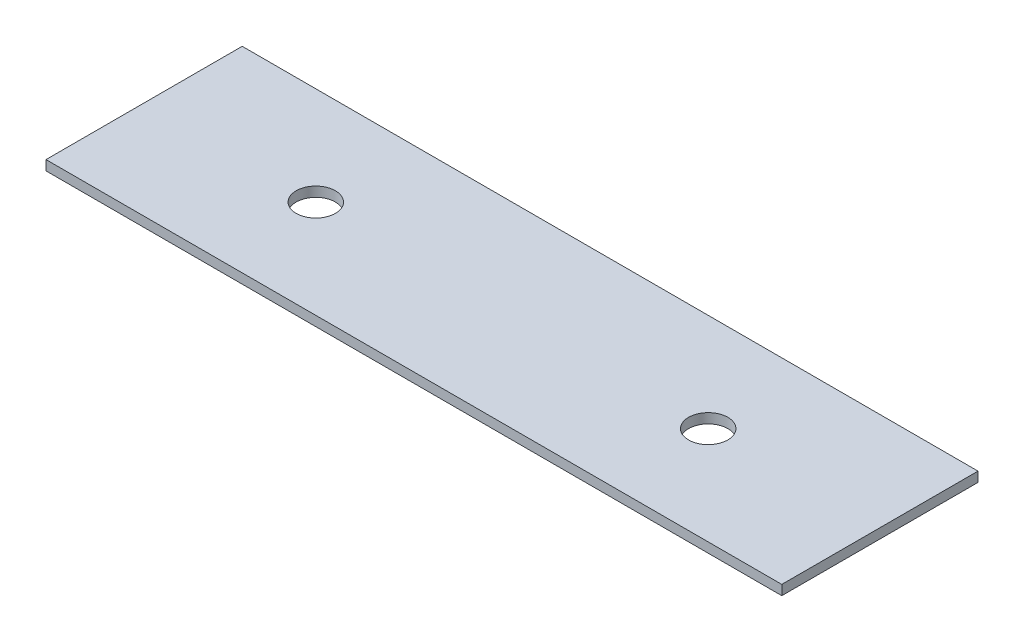
ISO-10303-21;
HEADER;
FILE_DESCRIPTION(('STEP AP214'),'2;1');
FILE_NAME('part.step','',(''),(''),'','','');
FILE_SCHEMA(('AUTOMOTIVE_DESIGN { 1 0 10303 214 1 1 1 1 }'));
ENDSEC;
DATA;
#1=APPLICATION_CONTEXT('core data for automotive mechanical design processes');
#2=APPLICATION_PROTOCOL_DEFINITION('international standard','automotive_design',2000,#1);
#3=PRODUCT_CONTEXT('',#1,'mechanical');
#4=PRODUCT('Part','Part','',(#3));
#5=PRODUCT_RELATED_PRODUCT_CATEGORY('part','',(#4));
#6=PRODUCT_DEFINITION_FORMATION('','',#4);
#7=PRODUCT_DEFINITION_CONTEXT('part definition',#1,'design');
#8=PRODUCT_DEFINITION('design','',#6,#7);
#9=PRODUCT_DEFINITION_SHAPE('','',#8);
#10=(LENGTH_UNIT() NAMED_UNIT(*) SI_UNIT(.MILLI.,.METRE.));
#11=(NAMED_UNIT(*) PLANE_ANGLE_UNIT() SI_UNIT($,.RADIAN.));
#12=(NAMED_UNIT(*) SI_UNIT($,.STERADIAN.) SOLID_ANGLE_UNIT());
#13=UNCERTAINTY_MEASURE_WITH_UNIT(LENGTH_MEASURE(1.E-05),#10,'distance_accuracy_value','');
#14=(GEOMETRIC_REPRESENTATION_CONTEXT(3) GLOBAL_UNCERTAINTY_ASSIGNED_CONTEXT((#13)) GLOBAL_UNIT_ASSIGNED_CONTEXT((#10,
#11,#12)) REPRESENTATION_CONTEXT('',''));
#15=CARTESIAN_POINT('',(0.,0.,0.));
#16=DIRECTION('',(0.,0.,1.));
#17=DIRECTION('',(1.,0.,0.));
#18=AXIS2_PLACEMENT_3D('',#15,#16,#17);
#19=CARTESIAN_POINT('',(75.,-2.,-20.));
#20=DIRECTION('',(1.,0.,0.));
#21=DIRECTION('',(0.,0.,-1.));
#22=AXIS2_PLACEMENT_3D('',#19,#20,#21);
#23=PLANE('',#22);
#24=DIRECTION('',(0.,0.,-1.));
#25=VECTOR('',#24,1.);
#26=CARTESIAN_POINT('',(75.,0.,-20.));
#27=LINE('',#26,#25);
#28=CARTESIAN_POINT('',(75.,0.,20.));
#29=VERTEX_POINT('',#28);
#30=CARTESIAN_POINT('',(75.,0.,-20.));
#31=VERTEX_POINT('',#30);
#32=EDGE_CURVE('E103',#29,#31,#27,.T.);
#33=ORIENTED_EDGE('',*,*,#32,.F.);
#34=DIRECTION('',(0.,1.,0.));
#35=VECTOR('',#34,1.);
#36=CARTESIAN_POINT('',(75.,-2.,20.));
#37=LINE('',#36,#35);
#38=CARTESIAN_POINT('',(75.,-2.,20.));
#39=VERTEX_POINT('',#38);
#40=EDGE_CURVE('E11',#39,#29,#37,.T.);
#41=ORIENTED_EDGE('',*,*,#40,.F.);
#42=DIRECTION('',(0.,0.,-1.));
#43=VECTOR('',#42,1.);
#44=CARTESIAN_POINT('',(75.,-2.,-20.));
#45=LINE('',#44,#43);
#46=CARTESIAN_POINT('',(75.,-2.,-20.));
#47=VERTEX_POINT('',#46);
#48=EDGE_CURVE('E96',#39,#47,#45,.T.);
#49=ORIENTED_EDGE('',*,*,#48,.T.);
#50=DIRECTION('',(0.,1.,0.));
#51=VECTOR('',#50,1.);
#52=CARTESIAN_POINT('',(75.,-2.,-20.));
#53=LINE('',#52,#51);
#54=EDGE_CURVE('E41',#47,#31,#53,.T.);
#55=ORIENTED_EDGE('',*,*,#54,.T.);
#56=EDGE_LOOP('',(#33,#41,#49,#55));
#57=FACE_BOUND('',#56,.T.);
#58=ADVANCED_FACE('F38',(#57),#23,.T.);
#59=CARTESIAN_POINT('',(-75.,-2.,20.));
#60=DIRECTION('',(0.,0.,1.));
#61=DIRECTION('',(1.,0.,0.));
#62=AXIS2_PLACEMENT_3D('',#59,#60,#61);
#63=PLANE('',#62);
#64=DIRECTION('',(1.,0.,0.));
#65=VECTOR('',#64,1.);
#66=CARTESIAN_POINT('',(-75.,0.,20.));
#67=LINE('',#66,#65);
#68=CARTESIAN_POINT('',(-75.,0.,20.));
#69=VERTEX_POINT('',#68);
#70=EDGE_CURVE('E98',#69,#29,#67,.T.);
#71=ORIENTED_EDGE('',*,*,#70,.F.);
#72=DIRECTION('',(0.,1.,0.));
#73=VECTOR('',#72,1.);
#74=CARTESIAN_POINT('',(-75.,-2.,20.));
#75=LINE('',#74,#73);
#76=CARTESIAN_POINT('',(-75.,-2.,20.));
#77=VERTEX_POINT('',#76);
#78=EDGE_CURVE('E47',#77,#69,#75,.T.);
#79=ORIENTED_EDGE('',*,*,#78,.F.);
#80=DIRECTION('',(1.,0.,0.));
#81=VECTOR('',#80,1.);
#82=CARTESIAN_POINT('',(-75.,-2.,20.));
#83=LINE('',#82,#81);
#84=EDGE_CURVE('E93',#77,#39,#83,.T.);
#85=ORIENTED_EDGE('',*,*,#84,.T.);
#86=ORIENTED_EDGE('',*,*,#40,.T.);
#87=EDGE_LOOP('',(#71,#79,#85,#86));
#88=FACE_BOUND('',#87,.T.);
#89=ADVANCED_FACE('F114',(#88),#63,.T.);
#90=CARTESIAN_POINT('',(-75.,-2.,-20.));
#91=DIRECTION('',(-1.,0.,0.));
#92=DIRECTION('',(0.,0.,1.));
#93=AXIS2_PLACEMENT_3D('',#90,#91,#92);
#94=PLANE('',#93);
#95=DIRECTION('',(0.,0.,1.));
#96=VECTOR('',#95,1.);
#97=CARTESIAN_POINT('',(-75.,0.,-20.));
#98=LINE('',#97,#96);
#99=CARTESIAN_POINT('',(-75.,0.,-20.));
#100=VERTEX_POINT('',#99);
#101=EDGE_CURVE('E88',#100,#69,#98,.T.);
#102=ORIENTED_EDGE('',*,*,#101,.F.);
#103=DIRECTION('',(0.,1.,0.));
#104=VECTOR('',#103,1.);
#105=CARTESIAN_POINT('',(-75.,-2.,-20.));
#106=LINE('',#105,#104);
#107=CARTESIAN_POINT('',(-75.,-2.,-20.));
#108=VERTEX_POINT('',#107);
#109=EDGE_CURVE('E83',#108,#100,#106,.T.);
#110=ORIENTED_EDGE('',*,*,#109,.F.);
#111=DIRECTION('',(0.,0.,1.));
#112=VECTOR('',#111,1.);
#113=CARTESIAN_POINT('',(-75.,-2.,-20.));
#114=LINE('',#113,#112);
#115=EDGE_CURVE('E86',#108,#77,#114,.T.);
#116=ORIENTED_EDGE('',*,*,#115,.T.);
#117=ORIENTED_EDGE('',*,*,#78,.T.);
#118=EDGE_LOOP('',(#102,#110,#116,#117));
#119=FACE_BOUND('',#118,.T.);
#120=ADVANCED_FACE('F85',(#119),#94,.T.);
#121=CARTESIAN_POINT('',(-75.,-2.,-20.));
#122=DIRECTION('',(0.,0.,-1.));
#123=DIRECTION('',(-1.,0.,0.));
#124=AXIS2_PLACEMENT_3D('',#121,#122,#123);
#125=PLANE('',#124);
#126=DIRECTION('',(-1.,0.,0.));
#127=VECTOR('',#126,1.);
#128=CARTESIAN_POINT('',(-75.,0.,-20.));
#129=LINE('',#128,#127);
#130=EDGE_CURVE('E106',#31,#100,#129,.T.);
#131=ORIENTED_EDGE('',*,*,#130,.F.);
#132=ORIENTED_EDGE('',*,*,#54,.F.);
#133=DIRECTION('',(-1.,0.,0.));
#134=VECTOR('',#133,1.);
#135=CARTESIAN_POINT('',(-75.,-2.,-20.));
#136=LINE('',#135,#134);
#137=EDGE_CURVE('E92',#47,#108,#136,.T.);
#138=ORIENTED_EDGE('',*,*,#137,.T.);
#139=ORIENTED_EDGE('',*,*,#109,.T.);
#140=EDGE_LOOP('',(#131,#132,#138,#139));
#141=FACE_BOUND('',#140,.T.);
#142=ADVANCED_FACE('F95',(#141),#125,.T.);
#143=CARTESIAN_POINT('',(0.,-2.,0.));
#144=DIRECTION('',(0.,1.,0.));
#145=DIRECTION('',(0.,0.,1.));
#146=AXIS2_PLACEMENT_3D('',#143,#144,#145);
#147=PLANE('',#146);
#148=CARTESIAN_POINT('',(40.,-2.,0.));
#149=DIRECTION('',(0.,1.,0.));
#150=DIRECTION('',(0.,0.,-1.));
#151=AXIS2_PLACEMENT_3D('',#148,#149,#150);
#152=CIRCLE('',#151,4.00000000000001);
#153=CARTESIAN_POINT('',(40.,-2.,-4.00000000000004));
#154=VERTEX_POINT('',#153);
#155=EDGE_CURVE('E147',#154,#154,#152,.T.);
#156=ORIENTED_EDGE('',*,*,#155,.T.);
#157=EDGE_LOOP('',(#156));
#158=FACE_BOUND('',#157,.T.);
#159=CARTESIAN_POINT('',(-40.,-2.,0.));
#160=DIRECTION('',(0.,1.,0.));
#161=DIRECTION('',(0.,0.,1.));
#162=AXIS2_PLACEMENT_3D('',#159,#160,#161);
#163=CIRCLE('',#162,4.00000000000001);
#164=CARTESIAN_POINT('',(-40.,-2.,3.99999999999999));
#165=VERTEX_POINT('',#164);
#166=EDGE_CURVE('E107',#165,#165,#163,.T.);
#167=ORIENTED_EDGE('',*,*,#166,.T.);
#168=EDGE_LOOP('',(#167));
#169=FACE_BOUND('',#168,.T.);
#170=ORIENTED_EDGE('',*,*,#48,.F.);
#171=ORIENTED_EDGE('',*,*,#84,.F.);
#172=ORIENTED_EDGE('',*,*,#115,.F.);
#173=ORIENTED_EDGE('',*,*,#137,.F.);
#174=EDGE_LOOP('',(#170,#171,#172,#173));
#175=FACE_BOUND('',#174,.T.);
#176=ADVANCED_FACE('F91',(#158,#169,#175),#147,.F.);
#177=CARTESIAN_POINT('',(0.,0.,0.));
#178=DIRECTION('',(0.,1.,0.));
#179=DIRECTION('',(0.,0.,1.));
#180=AXIS2_PLACEMENT_3D('',#177,#178,#179);
#181=PLANE('',#180);
#182=CARTESIAN_POINT('',(40.,0.,0.));
#183=DIRECTION('',(0.,1.,0.));
#184=DIRECTION('',(0.,0.,-1.));
#185=AXIS2_PLACEMENT_3D('',#182,#183,#184);
#186=CIRCLE('',#185,4.00000000000001);
#187=CARTESIAN_POINT('',(40.,0.,-4.00000000000004));
#188=VERTEX_POINT('',#187);
#189=EDGE_CURVE('E150',#188,#188,#186,.T.);
#190=ORIENTED_EDGE('',*,*,#189,.F.);
#191=EDGE_LOOP('',(#190));
#192=FACE_BOUND('',#191,.T.);
#193=CARTESIAN_POINT('',(-40.,0.,0.));
#194=DIRECTION('',(0.,1.,0.));
#195=DIRECTION('',(0.,0.,1.));
#196=AXIS2_PLACEMENT_3D('',#193,#194,#195);
#197=CIRCLE('',#196,4.00000000000001);
#198=CARTESIAN_POINT('',(-40.,0.,3.99999999999999));
#199=VERTEX_POINT('',#198);
#200=EDGE_CURVE('E152',#199,#199,#197,.T.);
#201=ORIENTED_EDGE('',*,*,#200,.F.);
#202=EDGE_LOOP('',(#201));
#203=FACE_BOUND('',#202,.T.);
#204=ORIENTED_EDGE('',*,*,#32,.T.);
#205=ORIENTED_EDGE('',*,*,#130,.T.);
#206=ORIENTED_EDGE('',*,*,#101,.T.);
#207=ORIENTED_EDGE('',*,*,#70,.T.);
#208=EDGE_LOOP('',(#204,#205,#206,#207));
#209=FACE_BOUND('',#208,.T.);
#210=ADVANCED_FACE('F113',(#192,#203,#209),#181,.T.);
#211=CARTESIAN_POINT('',(-40.,-2.,0.));
#212=DIRECTION('',(0.,1.,0.));
#213=DIRECTION('',(0.,0.,1.));
#214=AXIS2_PLACEMENT_3D('',#211,#212,#213);
#215=CYLINDRICAL_SURFACE('',#214,4.00000000000001);
#216=ORIENTED_EDGE('',*,*,#166,.F.);
#217=EDGE_LOOP('',(#216));
#218=FACE_BOUND('',#217,.T.);
#219=ORIENTED_EDGE('',*,*,#200,.T.);
#220=EDGE_LOOP('',(#219));
#221=FACE_BOUND('',#220,.T.);
#222=ADVANCED_FACE('F132',(#218,#221),#215,.F.);
#223=CARTESIAN_POINT('',(40.,-2.,0.));
#224=DIRECTION('',(0.,1.,0.));
#225=DIRECTION('',(0.,0.,1.));
#226=AXIS2_PLACEMENT_3D('',#223,#224,#225);
#227=CYLINDRICAL_SURFACE('',#226,4.00000000000001);
#228=ORIENTED_EDGE('',*,*,#155,.F.);
#229=EDGE_LOOP('',(#228));
#230=FACE_BOUND('',#229,.T.);
#231=ORIENTED_EDGE('',*,*,#189,.T.);
#232=EDGE_LOOP('',(#231));
#233=FACE_BOUND('',#232,.T.);
#234=ADVANCED_FACE('F139',(#230,#233),#227,.F.);
#235=CLOSED_SHELL('',(#58,#89,#120,#142,#176,#210,#222,#234));
#236=MANIFOLD_SOLID_BREP('B2',#235);
#237=ADVANCED_BREP_SHAPE_REPRESENTATION('',(#18,#236),#14);
#238=SHAPE_DEFINITION_REPRESENTATION(#9,#237);
ENDSEC;
END-ISO-10303-21;
